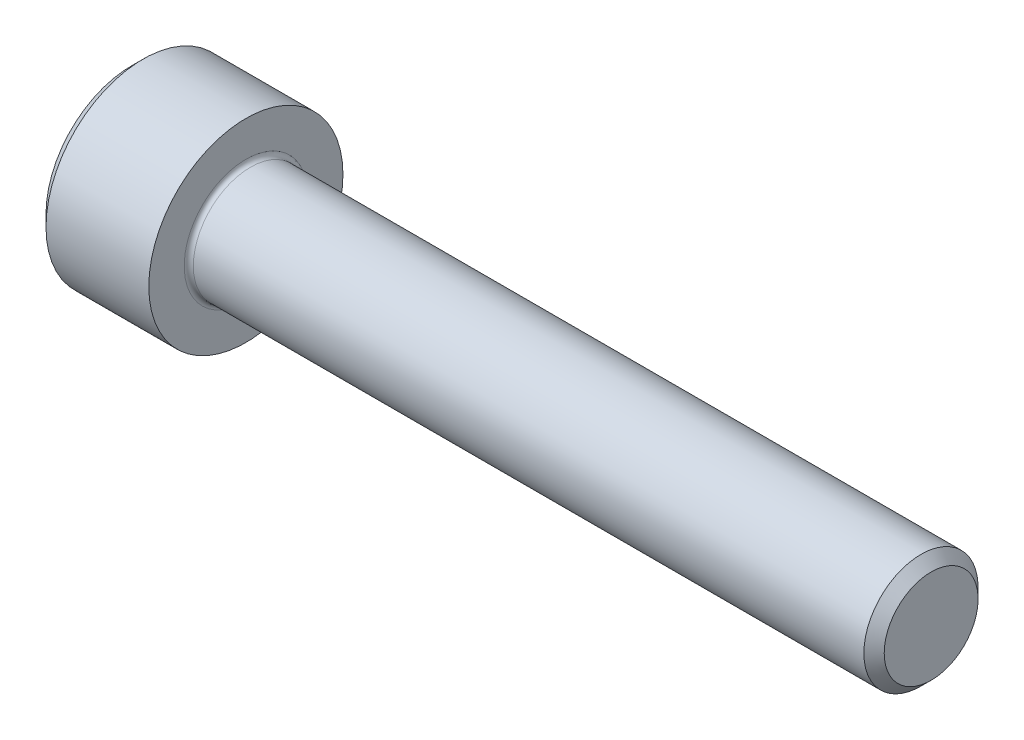
ISO-10303-21;
HEADER;
FILE_DESCRIPTION(('STEP AP214'),'2;1');
FILE_NAME('part.step','',(''),(''),'','','');
FILE_SCHEMA(('AUTOMOTIVE_DESIGN { 1 0 10303 214 1 1 1 1 }'));
ENDSEC;
DATA;
#1=APPLICATION_CONTEXT('core data for automotive mechanical design processes');
#2=APPLICATION_PROTOCOL_DEFINITION('international standard','automotive_design',2000,#1);
#3=PRODUCT_CONTEXT('',#1,'mechanical');
#4=PRODUCT('Part','Part','',(#3));
#5=PRODUCT_RELATED_PRODUCT_CATEGORY('part','',(#4));
#6=PRODUCT_DEFINITION_FORMATION('','',#4);
#7=PRODUCT_DEFINITION_CONTEXT('part definition',#1,'design');
#8=PRODUCT_DEFINITION('design','',#6,#7);
#9=PRODUCT_DEFINITION_SHAPE('','',#8);
#10=(LENGTH_UNIT() NAMED_UNIT(*) SI_UNIT(.MILLI.,.METRE.));
#11=(NAMED_UNIT(*) PLANE_ANGLE_UNIT() SI_UNIT($,.RADIAN.));
#12=(NAMED_UNIT(*) SI_UNIT($,.STERADIAN.) SOLID_ANGLE_UNIT());
#13=UNCERTAINTY_MEASURE_WITH_UNIT(LENGTH_MEASURE(1.E-05),#10,'distance_accuracy_value','');
#14=(GEOMETRIC_REPRESENTATION_CONTEXT(3) GLOBAL_UNCERTAINTY_ASSIGNED_CONTEXT((#13)) GLOBAL_UNIT_ASSIGNED_CONTEXT((#10,
#11,#12)) REPRESENTATION_CONTEXT('',''));
#15=CARTESIAN_POINT('',(0.,0.,0.));
#16=DIRECTION('',(0.,0.,1.));
#17=DIRECTION('',(1.,0.,0.));
#18=AXIS2_PLACEMENT_3D('',#15,#16,#17);
#19=CARTESIAN_POINT('',(0.,0.,0.));
#20=DIRECTION('',(-1.,0.,0.));
#21=DIRECTION('',(0.,0.,1.));
#22=AXIS2_PLACEMENT_3D('',#19,#20,#21);
#23=PLANE('',#22);
#24=CARTESIAN_POINT('',(0.,0.,0.));
#25=DIRECTION('',(-1.,0.,0.));
#26=DIRECTION('',(0.,0.,1.));
#27=AXIS2_PLACEMENT_3D('',#24,#25,#26);
#28=CIRCLE('',#27,3.75);
#29=CARTESIAN_POINT('',(0.,0.,3.75));
#30=VERTEX_POINT('',#29);
#31=EDGE_CURVE('E44',#30,#30,#28,.T.);
#32=ORIENTED_EDGE('',*,*,#31,.T.);
#33=EDGE_LOOP('',(#32));
#34=FACE_BOUND('',#33,.T.);
#35=ADVANCED_FACE('F33',(#34),#23,.T.);
#36=CARTESIAN_POINT('',(0.,0.,0.));
#37=DIRECTION('',(1.,0.,0.));
#38=DIRECTION('',(0.,0.,-1.));
#39=AXIS2_PLACEMENT_3D('',#36,#37,#38);
#40=CONICAL_SURFACE('',#39,3.75,0.785398163397449);
#41=CARTESIAN_POINT('',(0.5,0.,0.));
#42=DIRECTION('',(-1.,0.,0.));
#43=DIRECTION('',(0.,0.,1.));
#44=AXIS2_PLACEMENT_3D('',#41,#42,#43);
#45=CIRCLE('',#44,4.25);
#46=CARTESIAN_POINT('',(0.5,0.,4.25));
#47=VERTEX_POINT('',#46);
#48=EDGE_CURVE('E48',#47,#47,#45,.T.);
#49=ORIENTED_EDGE('',*,*,#48,.T.);
#50=EDGE_LOOP('',(#49));
#51=FACE_BOUND('',#50,.T.);
#52=ORIENTED_EDGE('',*,*,#31,.F.);
#53=EDGE_LOOP('',(#52));
#54=FACE_BOUND('',#53,.T.);
#55=ADVANCED_FACE('F77',(#51,#54),#40,.T.);
#56=CARTESIAN_POINT('',(-31.75,0.,0.));
#57=DIRECTION('',(-1.,0.,0.));
#58=DIRECTION('',(0.,0.,1.));
#59=AXIS2_PLACEMENT_3D('',#56,#57,#58);
#60=CYLINDRICAL_SURFACE('',#59,4.25);
#61=CARTESIAN_POINT('',(5.,0.,0.));
#62=DIRECTION('',(-1.,0.,0.));
#63=DIRECTION('',(0.,0.,1.));
#64=AXIS2_PLACEMENT_3D('',#61,#62,#63);
#65=CIRCLE('',#64,4.25);
#66=CARTESIAN_POINT('',(5.,0.,4.25));
#67=VERTEX_POINT('',#66);
#68=EDGE_CURVE('E53',#67,#67,#65,.T.);
#69=ORIENTED_EDGE('',*,*,#68,.T.);
#70=EDGE_LOOP('',(#69));
#71=FACE_BOUND('',#70,.T.);
#72=ORIENTED_EDGE('',*,*,#48,.F.);
#73=EDGE_LOOP('',(#72));
#74=FACE_BOUND('',#73,.T.);
#75=ADVANCED_FACE('F82',(#71,#74),#60,.T.);
#76=CARTESIAN_POINT('',(5.,4.25,0.));
#77=DIRECTION('',(1.,0.,0.));
#78=DIRECTION('',(0.,0.,-1.));
#79=AXIS2_PLACEMENT_3D('',#76,#77,#78);
#80=PLANE('',#79);
#81=CARTESIAN_POINT('',(5.,0.,0.));
#82=DIRECTION('',(1.,0.,0.));
#83=DIRECTION('',(0.,0.,-1.));
#84=AXIS2_PLACEMENT_3D('',#81,#82,#83);
#85=CIRCLE('',#84,2.69999999999998);
#86=CARTESIAN_POINT('',(5.,0.,-2.69999999999998));
#87=VERTEX_POINT('',#86);
#88=EDGE_CURVE('E40',#87,#87,#85,.F.);
#89=ORIENTED_EDGE('',*,*,#88,.T.);
#90=EDGE_LOOP('',(#89));
#91=FACE_BOUND('',#90,.T.);
#92=ORIENTED_EDGE('',*,*,#68,.F.);
#93=EDGE_LOOP('',(#92));
#94=FACE_BOUND('',#93,.T.);
#95=ADVANCED_FACE('F88',(#91,#94),#80,.T.);
#96=CARTESIAN_POINT('',(-31.75,0.,0.));
#97=DIRECTION('',(-1.,0.,0.));
#98=DIRECTION('',(0.,0.,1.));
#99=AXIS2_PLACEMENT_3D('',#96,#97,#98);
#100=CYLINDRICAL_SURFACE('',#99,2.49999999999998);
#101=CARTESIAN_POINT('',(5.2,0.,0.));
#102=DIRECTION('',(1.,0.,0.));
#103=DIRECTION('',(0.,0.,-1.));
#104=AXIS2_PLACEMENT_3D('',#101,#102,#103);
#105=CIRCLE('',#104,2.49999999999998);
#106=CARTESIAN_POINT('',(5.2,0.,-2.49999999999998));
#107=VERTEX_POINT('',#106);
#108=EDGE_CURVE('E10',#107,#107,#105,.T.);
#109=ORIENTED_EDGE('',*,*,#108,.T.);
#110=EDGE_LOOP('',(#109));
#111=FACE_BOUND('',#110,.T.);
#112=CARTESIAN_POINT('',(34.555,0.,0.));
#113=DIRECTION('',(-1.,0.,0.));
#114=DIRECTION('',(0.,0.,1.));
#115=AXIS2_PLACEMENT_3D('',#112,#113,#114);
#116=CIRCLE('',#115,2.49999999999995);
#117=CARTESIAN_POINT('',(34.555,0.,2.49999999999995));
#118=VERTEX_POINT('',#117);
#119=EDGE_CURVE('E56',#118,#118,#116,.T.);
#120=ORIENTED_EDGE('',*,*,#119,.T.);
#121=EDGE_LOOP('',(#120));
#122=FACE_BOUND('',#121,.T.);
#123=ADVANCED_FACE('F73',(#111,#122),#100,.T.);
#124=CARTESIAN_POINT('',(35.,0.,0.));
#125=DIRECTION('',(-1.,0.,0.));
#126=DIRECTION('',(0.,0.,1.));
#127=AXIS2_PLACEMENT_3D('',#124,#125,#126);
#128=CONICAL_SURFACE('',#127,2.055,0.785398163397362);
#129=ORIENTED_EDGE('',*,*,#119,.F.);
#130=EDGE_LOOP('',(#129));
#131=FACE_BOUND('',#130,.T.);
#132=CARTESIAN_POINT('',(35.,0.,0.));
#133=DIRECTION('',(-1.,0.,0.));
#134=DIRECTION('',(0.,0.,1.));
#135=AXIS2_PLACEMENT_3D('',#132,#133,#134);
#136=CIRCLE('',#135,2.055);
#137=CARTESIAN_POINT('',(35.,0.,2.055));
#138=VERTEX_POINT('',#137);
#139=EDGE_CURVE('E59',#138,#138,#136,.T.);
#140=ORIENTED_EDGE('',*,*,#139,.T.);
#141=EDGE_LOOP('',(#140));
#142=FACE_BOUND('',#141,.T.);
#143=ADVANCED_FACE('F63',(#131,#142),#128,.T.);
#144=CARTESIAN_POINT('',(35.,2.055,0.));
#145=DIRECTION('',(1.,0.,0.));
#146=DIRECTION('',(0.,0.,-1.));
#147=AXIS2_PLACEMENT_3D('',#144,#145,#146);
#148=PLANE('',#147);
#149=ORIENTED_EDGE('',*,*,#139,.F.);
#150=EDGE_LOOP('',(#149));
#151=FACE_BOUND('',#150,.T.);
#152=ADVANCED_FACE('F65',(#151),#148,.T.);
#153=CARTESIAN_POINT('',(5.2,0.,0.));
#154=DIRECTION('',(1.,0.,0.));
#155=DIRECTION('',(0.,0.,-1.));
#156=AXIS2_PLACEMENT_3D('',#153,#154,#155);
#157=TOROIDAL_SURFACE('',#156,2.69999999999998,0.2);
#158=ORIENTED_EDGE('',*,*,#108,.F.);
#159=EDGE_LOOP('',(#158));
#160=FACE_BOUND('',#159,.T.);
#161=ORIENTED_EDGE('',*,*,#88,.F.);
#162=EDGE_LOOP('',(#161));
#163=FACE_BOUND('',#162,.T.);
#164=ADVANCED_FACE('F35',(#160,#163),#157,.F.);
#165=CLOSED_SHELL('',(#35,#55,#75,#95,#123,#143,#152,#164));
#166=MANIFOLD_SOLID_BREP('B2',#165);
#167=ADVANCED_BREP_SHAPE_REPRESENTATION('',(#18,#166),#14);
#168=SHAPE_DEFINITION_REPRESENTATION(#9,#167);
ENDSEC;
END-ISO-10303-21;
